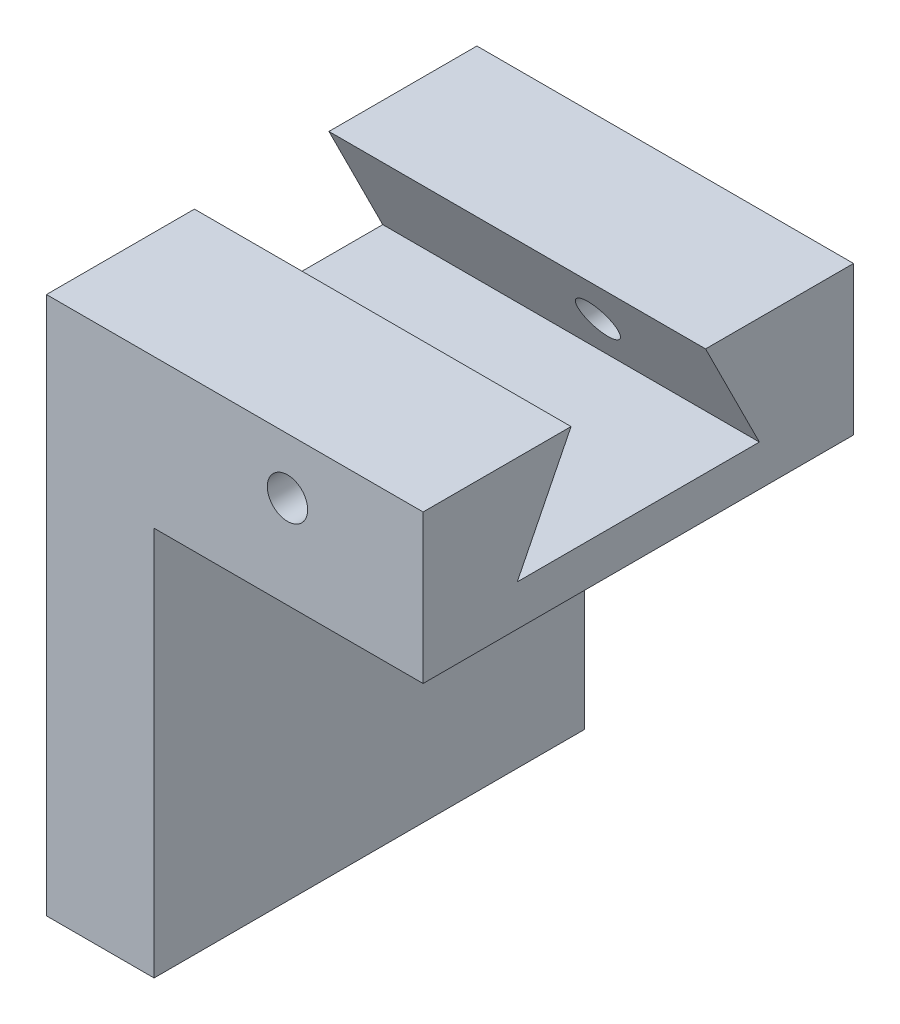
ISO-10303-21;
HEADER;
FILE_DESCRIPTION(('STEP AP214'),'2;1');
FILE_NAME('part.step','',(''),(''),'','','');
FILE_SCHEMA(('AUTOMOTIVE_DESIGN { 1 0 10303 214 1 1 1 1 }'));
ENDSEC;
DATA;
#1=APPLICATION_CONTEXT('core data for automotive mechanical design processes');
#2=APPLICATION_PROTOCOL_DEFINITION('international standard','automotive_design',2000,#1);
#3=PRODUCT_CONTEXT('',#1,'mechanical');
#4=PRODUCT('Part','Part','',(#3));
#5=PRODUCT_RELATED_PRODUCT_CATEGORY('part','',(#4));
#6=PRODUCT_DEFINITION_FORMATION('','',#4);
#7=PRODUCT_DEFINITION_CONTEXT('part definition',#1,'design');
#8=PRODUCT_DEFINITION('design','',#6,#7);
#9=PRODUCT_DEFINITION_SHAPE('','',#8);
#10=(LENGTH_UNIT() NAMED_UNIT(*) SI_UNIT(.MILLI.,.METRE.));
#11=(NAMED_UNIT(*) PLANE_ANGLE_UNIT() SI_UNIT($,.RADIAN.));
#12=(NAMED_UNIT(*) SI_UNIT($,.STERADIAN.) SOLID_ANGLE_UNIT());
#13=UNCERTAINTY_MEASURE_WITH_UNIT(LENGTH_MEASURE(1.E-05),#10,'distance_accuracy_value','');
#14=(GEOMETRIC_REPRESENTATION_CONTEXT(3) GLOBAL_UNCERTAINTY_ASSIGNED_CONTEXT((#13)) GLOBAL_UNIT_ASSIGNED_CONTEXT((#10,
#11,#12)) REPRESENTATION_CONTEXT('',''));
#15=CARTESIAN_POINT('',(0.,0.,0.));
#16=DIRECTION('',(0.,0.,1.));
#17=DIRECTION('',(1.,0.,0.));
#18=AXIS2_PLACEMENT_3D('',#15,#16,#17);
#19=CARTESIAN_POINT('',(-9.501,2.5,4.));
#20=DIRECTION('',(0.,-1.,0.));
#21=DIRECTION('',(0.,0.,-1.));
#22=AXIS2_PLACEMENT_3D('',#19,#20,#21);
#23=PLANE('',#22);
#24=DIRECTION('',(-1.,0.,0.));
#25=VECTOR('',#24,1.);
#26=CARTESIAN_POINT('',(-2.5,2.5,1.25));
#27=LINE('',#26,#25);
#28=CARTESIAN_POINT('',(-2.5,2.5,1.25));
#29=VERTEX_POINT('',#28);
#30=CARTESIAN_POINT('',(-9.5,2.5,1.25));
#31=VERTEX_POINT('',#30);
#32=EDGE_CURVE('E128',#29,#31,#27,.T.);
#33=ORIENTED_EDGE('',*,*,#32,.T.);
#34=DIRECTION('',(0.,0.,-1.));
#35=VECTOR('',#34,1.);
#36=CARTESIAN_POINT('',(-9.5,2.5,4.));
#37=LINE('',#36,#35);
#38=CARTESIAN_POINT('',(-9.5,2.5,4.));
#39=VERTEX_POINT('',#38);
#40=EDGE_CURVE('E159',#39,#31,#37,.T.);
#41=ORIENTED_EDGE('',*,*,#40,.F.);
#42=DIRECTION('',(1.,0.,0.));
#43=VECTOR('',#42,1.);
#44=CARTESIAN_POINT('',(-9.501,2.5,4.));
#45=LINE('',#44,#43);
#46=CARTESIAN_POINT('',(-2.5,2.5,4.));
#47=VERTEX_POINT('',#46);
#48=EDGE_CURVE('E157',#39,#47,#45,.T.);
#49=ORIENTED_EDGE('',*,*,#48,.T.);
#50=DIRECTION('',(0.,0.,1.));
#51=VECTOR('',#50,1.);
#52=CARTESIAN_POINT('',(-2.5,2.5,0.));
#53=LINE('',#52,#51);
#54=EDGE_CURVE('E77',#29,#47,#53,.T.);
#55=ORIENTED_EDGE('',*,*,#54,.F.);
#56=EDGE_LOOP('',(#33,#41,#49,#55));
#57=FACE_BOUND('',#56,.T.);
#58=ADVANCED_FACE('F36',(#57),#23,.F.);
#59=CARTESIAN_POINT('',(-7.5,-4.5,-4.001));
#60=DIRECTION('',(-1.,0.,0.));
#61=DIRECTION('',(0.,0.,1.));
#62=AXIS2_PLACEMENT_3D('',#59,#60,#61);
#63=PLANE('',#62);
#64=DIRECTION('',(0.,0.,-1.));
#65=VECTOR('',#64,1.);
#66=CARTESIAN_POINT('',(-7.5,-0.26095287369543,0.));
#67=LINE('',#66,#65);
#68=CARTESIAN_POINT('',(-7.5,-0.26095287369543,4.));
#69=VERTEX_POINT('',#68);
#70=CARTESIAN_POINT('',(-7.5,-0.26095287369543,-4.));
#71=VERTEX_POINT('',#70);
#72=EDGE_CURVE('E124',#69,#71,#67,.T.);
#73=ORIENTED_EDGE('',*,*,#72,.F.);
#74=DIRECTION('',(0.,-1.,0.));
#75=VECTOR('',#74,1.);
#76=CARTESIAN_POINT('',(-7.5,-4.5,4.));
#77=LINE('',#76,#75);
#78=CARTESIAN_POINT('',(-7.5,-7.50095287369543,4.));
#79=VERTEX_POINT('',#78);
#80=EDGE_CURVE('E140',#69,#79,#77,.T.);
#81=ORIENTED_EDGE('',*,*,#80,.T.);
#82=DIRECTION('',(0.,0.,-1.));
#83=VECTOR('',#82,1.);
#84=CARTESIAN_POINT('',(-7.5,-7.50095287369543,11.5111650228177));
#85=LINE('',#84,#83);
#86=CARTESIAN_POINT('',(-7.5,-7.50095287369543,-4.));
#87=VERTEX_POINT('',#86);
#88=EDGE_CURVE('E174',#79,#87,#85,.T.);
#89=ORIENTED_EDGE('',*,*,#88,.T.);
#90=DIRECTION('',(0.,1.,0.));
#91=VECTOR('',#90,1.);
#92=CARTESIAN_POINT('',(-7.5,-4.5,-4.));
#93=LINE('',#92,#91);
#94=EDGE_CURVE('E137',#87,#71,#93,.T.);
#95=ORIENTED_EDGE('',*,*,#94,.T.);
#96=EDGE_LOOP('',(#73,#81,#89,#95));
#97=FACE_BOUND('',#96,.T.);
#98=ADVANCED_FACE('F171',(#97),#63,.F.);
#99=CARTESIAN_POINT('',(-9.5,-4.5,4.));
#100=DIRECTION('',(-1.,0.,0.));
#101=DIRECTION('',(0.,0.,1.));
#102=AXIS2_PLACEMENT_3D('',#99,#100,#101);
#103=PLANE('',#102);
#104=DIRECTION('',(0.,-0.894427192382073,0.447213592735644));
#105=VECTOR('',#104,1.);
#106=CARTESIAN_POINT('',(-9.5,0.499999988410264,2.24999999806838));
#107=LINE('',#106,#105);
#108=CARTESIAN_POINT('',(-9.5,0.499999988410264,2.24999999806838));
#109=VERTEX_POINT('',#108);
#110=EDGE_CURVE('E188',#31,#109,#107,.T.);
#111=ORIENTED_EDGE('',*,*,#110,.T.);
#112=DIRECTION('',(0.,0.,-1.));
#113=VECTOR('',#112,1.);
#114=CARTESIAN_POINT('',(-9.5,0.499999988410264,-2.24999999806838));
#115=LINE('',#114,#113);
#116=CARTESIAN_POINT('',(-9.5,0.499999988410264,-2.24999999806838));
#117=VERTEX_POINT('',#116);
#118=EDGE_CURVE('E207',#109,#117,#115,.T.);
#119=ORIENTED_EDGE('',*,*,#118,.T.);
#120=DIRECTION('',(0.,0.894427192382073,0.447213592735644));
#121=VECTOR('',#120,1.);
#122=CARTESIAN_POINT('',(-9.5,2.5,-1.25));
#123=LINE('',#122,#121);
#124=CARTESIAN_POINT('',(-9.5,2.5,-1.25));
#125=VERTEX_POINT('',#124);
#126=EDGE_CURVE('E185',#117,#125,#123,.T.);
#127=ORIENTED_EDGE('',*,*,#126,.T.);
#128=CARTESIAN_POINT('',(-9.5,2.5,-4.));
#129=VERTEX_POINT('',#128);
#130=EDGE_CURVE('E99',#125,#129,#37,.T.);
#131=ORIENTED_EDGE('',*,*,#130,.T.);
#132=DIRECTION('',(0.,1.,0.));
#133=VECTOR('',#132,1.);
#134=CARTESIAN_POINT('',(-9.5,-4.5,-4.));
#135=LINE('',#134,#133);
#136=CARTESIAN_POINT('',(-9.5,-7.50095287369543,-4.));
#137=VERTEX_POINT('',#136);
#138=EDGE_CURVE('E46',#137,#129,#135,.T.);
#139=ORIENTED_EDGE('',*,*,#138,.F.);
#140=DIRECTION('',(0.,0.,-1.));
#141=VECTOR('',#140,1.);
#142=CARTESIAN_POINT('',(-9.5,-7.50095287369543,11.5111650228177));
#143=LINE('',#142,#141);
#144=CARTESIAN_POINT('',(-9.5,-7.50095287369543,4.));
#145=VERTEX_POINT('',#144);
#146=EDGE_CURVE('E181',#145,#137,#143,.T.);
#147=ORIENTED_EDGE('',*,*,#146,.F.);
#148=DIRECTION('',(0.,1.,0.));
#149=VECTOR('',#148,1.);
#150=CARTESIAN_POINT('',(-9.5,-4.5,4.));
#151=LINE('',#150,#149);
#152=EDGE_CURVE('E11',#145,#39,#151,.T.);
#153=ORIENTED_EDGE('',*,*,#152,.T.);
#154=ORIENTED_EDGE('',*,*,#40,.T.);
#155=EDGE_LOOP('',(#111,#119,#127,#131,#139,#147,#153,#154));
#156=FACE_BOUND('',#155,.T.);
#157=ADVANCED_FACE('F38',(#156),#103,.T.);
#158=CARTESIAN_POINT('',(0.,0.,4.));
#159=DIRECTION('',(0.,0.,1.));
#160=DIRECTION('',(1.,0.,0.));
#161=AXIS2_PLACEMENT_3D('',#158,#159,#160);
#162=PLANE('',#161);
#163=ORIENTED_EDGE('',*,*,#48,.F.);
#164=ORIENTED_EDGE('',*,*,#152,.F.);
#165=DIRECTION('',(-1.,0.,0.));
#166=VECTOR('',#165,1.);
#167=CARTESIAN_POINT('',(-7.5,-7.50095287369543,4.));
#168=LINE('',#167,#166);
#169=EDGE_CURVE('E184',#79,#145,#168,.T.);
#170=ORIENTED_EDGE('',*,*,#169,.F.);
#171=ORIENTED_EDGE('',*,*,#80,.F.);
#172=DIRECTION('',(-1.,0.,0.));
#173=VECTOR('',#172,1.);
#174=CARTESIAN_POINT('',(-2.5,-0.26095287369543,4.));
#175=LINE('',#174,#173);
#176=CARTESIAN_POINT('',(-2.5,-0.26095287369543,4.));
#177=VERTEX_POINT('',#176);
#178=EDGE_CURVE('E67',#177,#69,#175,.T.);
#179=ORIENTED_EDGE('',*,*,#178,.F.);
#180=DIRECTION('',(0.,-1.,0.));
#181=VECTOR('',#180,1.);
#182=CARTESIAN_POINT('',(-2.5,0.,4.));
#183=LINE('',#182,#181);
#184=EDGE_CURVE('E126',#47,#177,#183,.T.);
#185=ORIENTED_EDGE('',*,*,#184,.F.);
#186=EDGE_LOOP('',(#163,#164,#170,#171,#179,#185));
#187=FACE_BOUND('',#186,.T.);
#188=CARTESIAN_POINT('',(-5.01992730877987,1.46282170187639,4.));
#189=DIRECTION('',(0.,0.,1.));
#190=DIRECTION('',(1.,0.,0.));
#191=AXIS2_PLACEMENT_3D('',#188,#189,#190);
#192=CIRCLE('',#191,0.375);
#193=CARTESIAN_POINT('',(-4.64492730877987,1.46282170187639,4.));
#194=VERTEX_POINT('',#193);
#195=EDGE_CURVE('E195',#194,#194,#192,.F.);
#196=ORIENTED_EDGE('',*,*,#195,.T.);
#197=EDGE_LOOP('',(#196));
#198=FACE_BOUND('',#197,.T.);
#199=ADVANCED_FACE('F222',(#187,#198),#162,.T.);
#200=CARTESIAN_POINT('',(0.,0.,-4.));
#201=DIRECTION('',(0.,0.,1.));
#202=DIRECTION('',(1.,0.,0.));
#203=AXIS2_PLACEMENT_3D('',#200,#201,#202);
#204=PLANE('',#203);
#205=CARTESIAN_POINT('',(-5.01992730877987,1.46282170187639,-4.));
#206=DIRECTION('',(0.,0.,-1.));
#207=DIRECTION('',(-1.,0.,0.));
#208=AXIS2_PLACEMENT_3D('',#205,#206,#207);
#209=CIRCLE('',#208,0.375);
#210=CARTESIAN_POINT('',(-5.39492730877987,1.46282170187639,-4.));
#211=VERTEX_POINT('',#210);
#212=EDGE_CURVE('E180',#211,#211,#209,.T.);
#213=ORIENTED_EDGE('',*,*,#212,.F.);
#214=EDGE_LOOP('',(#213));
#215=FACE_BOUND('',#214,.T.);
#216=DIRECTION('',(-1.,0.,0.));
#217=VECTOR('',#216,1.);
#218=CARTESIAN_POINT('',(-2.5,-0.26095287369543,-4.));
#219=LINE('',#218,#217);
#220=CARTESIAN_POINT('',(-2.5,-0.26095287369543,-4.));
#221=VERTEX_POINT('',#220);
#222=EDGE_CURVE('E104',#221,#71,#219,.T.);
#223=ORIENTED_EDGE('',*,*,#222,.T.);
#224=ORIENTED_EDGE('',*,*,#94,.F.);
#225=DIRECTION('',(-1.,0.,0.));
#226=VECTOR('',#225,1.);
#227=CARTESIAN_POINT('',(-7.5,-7.50095287369543,-4.));
#228=LINE('',#227,#226);
#229=EDGE_CURVE('E151',#87,#137,#228,.T.);
#230=ORIENTED_EDGE('',*,*,#229,.T.);
#231=ORIENTED_EDGE('',*,*,#138,.T.);
#232=DIRECTION('',(1.,0.,0.));
#233=VECTOR('',#232,1.);
#234=CARTESIAN_POINT('',(-9.501,2.5,-4.));
#235=LINE('',#234,#233);
#236=CARTESIAN_POINT('',(-2.5,2.5,-4.));
#237=VERTEX_POINT('',#236);
#238=EDGE_CURVE('E127',#129,#237,#235,.T.);
#239=ORIENTED_EDGE('',*,*,#238,.T.);
#240=DIRECTION('',(0.,1.,0.));
#241=VECTOR('',#240,1.);
#242=CARTESIAN_POINT('',(-2.5,0.,-4.));
#243=LINE('',#242,#241);
#244=EDGE_CURVE('E113',#221,#237,#243,.T.);
#245=ORIENTED_EDGE('',*,*,#244,.F.);
#246=EDGE_LOOP('',(#223,#224,#230,#231,#239,#245));
#247=FACE_BOUND('',#246,.T.);
#248=ADVANCED_FACE('F147',(#215,#247),#204,.F.);
#249=CARTESIAN_POINT('',(-2.5,-0.26095287369543,0.));
#250=DIRECTION('',(0.,1.,0.));
#251=DIRECTION('',(0.,0.,1.));
#252=AXIS2_PLACEMENT_3D('',#249,#250,#251);
#253=PLANE('',#252);
#254=ORIENTED_EDGE('',*,*,#72,.T.);
#255=ORIENTED_EDGE('',*,*,#222,.F.);
#256=DIRECTION('',(0.,0.,-1.));
#257=VECTOR('',#256,1.);
#258=CARTESIAN_POINT('',(-2.5,-0.26095287369543,0.));
#259=LINE('',#258,#257);
#260=EDGE_CURVE('E164',#177,#221,#259,.T.);
#261=ORIENTED_EDGE('',*,*,#260,.F.);
#262=ORIENTED_EDGE('',*,*,#178,.T.);
#263=EDGE_LOOP('',(#254,#255,#261,#262));
#264=FACE_BOUND('',#263,.T.);
#265=ADVANCED_FACE('F167',(#264),#253,.F.);
#266=CARTESIAN_POINT('',(-2.5,0.99999999150086,-1.9999999984547));
#267=DIRECTION('',(0.,0.447213592735644,-0.894427192382073));
#268=DIRECTION('',(0.,0.894427192382073,0.447213592735644));
#269=AXIS2_PLACEMENT_3D('',#266,#267,#268);
#270=PLANE('',#269);
#271=CARTESIAN_POINT('',(-5.01992730877987,1.46282170187639,-1.76858914505493));
#272=DIRECTION('',(0.,0.447213592735644,-0.894427192382073));
#273=DIRECTION('',(0.,-0.894427192382073,-0.447213592735644));
#274=AXIS2_PLACEMENT_3D('',#271,#272,#273);
#275=ELLIPSE('',#274,0.419262745133325,0.375);
#276=CARTESIAN_POINT('',(-5.01992730877987,1.08782170187639,-1.95608914360621));
#277=VERTEX_POINT('',#276);
#278=EDGE_CURVE('E198',#277,#277,#275,.T.);
#279=ORIENTED_EDGE('',*,*,#278,.T.);
#280=EDGE_LOOP('',(#279));
#281=FACE_BOUND('',#280,.T.);
#282=DIRECTION('',(-1.,0.,0.));
#283=VECTOR('',#282,1.);
#284=CARTESIAN_POINT('',(-2.5,2.5,-1.25));
#285=LINE('',#284,#283);
#286=CARTESIAN_POINT('',(-2.5,2.5,-1.25));
#287=VERTEX_POINT('',#286);
#288=EDGE_CURVE('E91',#287,#125,#285,.T.);
#289=ORIENTED_EDGE('',*,*,#288,.T.);
#290=ORIENTED_EDGE('',*,*,#126,.F.);
#291=DIRECTION('',(-1.,0.,0.));
#292=VECTOR('',#291,1.);
#293=CARTESIAN_POINT('',(-2.5,0.499999988410264,-2.24999999806838));
#294=LINE('',#293,#292);
#295=CARTESIAN_POINT('',(-2.5,0.499999988410264,-2.24999999806838));
#296=VERTEX_POINT('',#295);
#297=EDGE_CURVE('E105',#296,#117,#294,.T.);
#298=ORIENTED_EDGE('',*,*,#297,.F.);
#299=DIRECTION('',(0.,-0.894427192382073,-0.447213592735644));
#300=VECTOR('',#299,1.);
#301=CARTESIAN_POINT('',(-2.5,0.99999999150086,-1.9999999984547));
#302=LINE('',#301,#300);
#303=EDGE_CURVE('E110',#287,#296,#302,.T.);
#304=ORIENTED_EDGE('',*,*,#303,.F.);
#305=EDGE_LOOP('',(#289,#290,#298,#304));
#306=FACE_BOUND('',#305,.T.);
#307=ADVANCED_FACE('F115',(#281,#306),#270,.F.);
#308=CARTESIAN_POINT('',(-2.5,0.499999988410264,0.));
#309=DIRECTION('',(0.,-1.,0.));
#310=DIRECTION('',(0.,0.,-1.));
#311=AXIS2_PLACEMENT_3D('',#308,#309,#310);
#312=PLANE('',#311);
#313=ORIENTED_EDGE('',*,*,#297,.T.);
#314=ORIENTED_EDGE('',*,*,#118,.F.);
#315=DIRECTION('',(-1.,0.,0.));
#316=VECTOR('',#315,1.);
#317=CARTESIAN_POINT('',(-2.5,0.499999988410264,2.24999999806838));
#318=LINE('',#317,#316);
#319=CARTESIAN_POINT('',(-2.5,0.499999988410264,2.24999999806838));
#320=VERTEX_POINT('',#319);
#321=EDGE_CURVE('E130',#320,#109,#318,.T.);
#322=ORIENTED_EDGE('',*,*,#321,.F.);
#323=DIRECTION('',(0.,0.,1.));
#324=VECTOR('',#323,1.);
#325=CARTESIAN_POINT('',(-2.5,0.499999988410264,0.));
#326=LINE('',#325,#324);
#327=EDGE_CURVE('E55',#296,#320,#326,.T.);
#328=ORIENTED_EDGE('',*,*,#327,.F.);
#329=EDGE_LOOP('',(#313,#314,#322,#328));
#330=FACE_BOUND('',#329,.T.);
#331=ADVANCED_FACE('F252',(#330),#312,.F.);
#332=CARTESIAN_POINT('',(-2.5,0.999999991500858,1.9999999984547));
#333=DIRECTION('',(0.,-0.447213592735644,-0.894427192382073));
#334=DIRECTION('',(0.,0.894427192382073,-0.447213592735644));
#335=AXIS2_PLACEMENT_3D('',#332,#333,#334);
#336=PLANE('',#335);
#337=CARTESIAN_POINT('',(-5.01992730877987,1.46282170187639,1.76858914505493));
#338=DIRECTION('',(0.,-0.447213592735644,-0.894427192382073));
#339=DIRECTION('',(0.,0.894427192382073,-0.447213592735644));
#340=AXIS2_PLACEMENT_3D('',#337,#338,#339);
#341=ELLIPSE('',#340,0.419262745133325,0.375);
#342=CARTESIAN_POINT('',(-5.01992730877987,1.83782170187639,1.58108914650365));
#343=VERTEX_POINT('',#342);
#344=EDGE_CURVE('E40',#343,#343,#341,.T.);
#345=ORIENTED_EDGE('',*,*,#344,.F.);
#346=EDGE_LOOP('',(#345));
#347=FACE_BOUND('',#346,.T.);
#348=ORIENTED_EDGE('',*,*,#321,.T.);
#349=ORIENTED_EDGE('',*,*,#110,.F.);
#350=ORIENTED_EDGE('',*,*,#32,.F.);
#351=DIRECTION('',(0.,-0.894427192382073,0.447213592735644));
#352=VECTOR('',#351,1.);
#353=CARTESIAN_POINT('',(-2.5,0.999999991500858,1.9999999984547));
#354=LINE('',#353,#352);
#355=EDGE_CURVE('E118',#29,#320,#354,.T.);
#356=ORIENTED_EDGE('',*,*,#355,.T.);
#357=EDGE_LOOP('',(#348,#349,#350,#356));
#358=FACE_BOUND('',#357,.T.);
#359=ADVANCED_FACE('F249',(#347,#358),#336,.T.);
#360=CARTESIAN_POINT('',(-2.5,0.,0.));
#361=DIRECTION('',(1.,0.,0.));
#362=DIRECTION('',(0.,0.,-1.));
#363=AXIS2_PLACEMENT_3D('',#360,#361,#362);
#364=PLANE('',#363);
#365=ORIENTED_EDGE('',*,*,#184,.T.);
#366=ORIENTED_EDGE('',*,*,#260,.T.);
#367=ORIENTED_EDGE('',*,*,#244,.T.);
#368=EDGE_CURVE('E95',#237,#287,#53,.T.);
#369=ORIENTED_EDGE('',*,*,#368,.T.);
#370=ORIENTED_EDGE('',*,*,#303,.T.);
#371=ORIENTED_EDGE('',*,*,#327,.T.);
#372=ORIENTED_EDGE('',*,*,#355,.F.);
#373=ORIENTED_EDGE('',*,*,#54,.T.);
#374=EDGE_LOOP('',(#365,#366,#367,#369,#370,#371,#372,#373));
#375=FACE_BOUND('',#374,.T.);
#376=ADVANCED_FACE('F109',(#375),#364,.T.);
#377=ORIENTED_EDGE('',*,*,#130,.F.);
#378=ORIENTED_EDGE('',*,*,#288,.F.);
#379=ORIENTED_EDGE('',*,*,#368,.F.);
#380=ORIENTED_EDGE('',*,*,#238,.F.);
#381=EDGE_LOOP('',(#377,#378,#379,#380));
#382=FACE_BOUND('',#381,.T.);
#383=ADVANCED_FACE('F93',(#382),#23,.F.);
#384=CARTESIAN_POINT('',(-5.01992730877987,1.46282170187639,5.06066017177982));
#385=DIRECTION('',(0.,0.,-1.));
#386=DIRECTION('',(-1.,0.,0.));
#387=AXIS2_PLACEMENT_3D('',#384,#385,#386);
#388=CYLINDRICAL_SURFACE('',#387,0.375);
#389=ORIENTED_EDGE('',*,*,#344,.T.);
#390=EDGE_LOOP('',(#389));
#391=FACE_BOUND('',#390,.T.);
#392=ORIENTED_EDGE('',*,*,#195,.F.);
#393=EDGE_LOOP('',(#392));
#394=FACE_BOUND('',#393,.T.);
#395=ADVANCED_FACE('F228',(#391,#394),#388,.F.);
#396=ORIENTED_EDGE('',*,*,#212,.T.);
#397=EDGE_LOOP('',(#396));
#398=FACE_BOUND('',#397,.T.);
#399=ORIENTED_EDGE('',*,*,#278,.F.);
#400=EDGE_LOOP('',(#399));
#401=FACE_BOUND('',#400,.T.);
#402=ADVANCED_FACE('F230',(#398,#401),#388,.F.);
#403=CARTESIAN_POINT('',(-7.5,-7.50095287369543,11.5111650228177));
#404=DIRECTION('',(0.,-1.,0.));
#405=DIRECTION('',(0.,0.,-1.));
#406=AXIS2_PLACEMENT_3D('',#403,#404,#405);
#407=PLANE('',#406);
#408=ORIENTED_EDGE('',*,*,#88,.F.);
#409=ORIENTED_EDGE('',*,*,#169,.T.);
#410=ORIENTED_EDGE('',*,*,#146,.T.);
#411=ORIENTED_EDGE('',*,*,#229,.F.);
#412=EDGE_LOOP('',(#408,#409,#410,#411));
#413=FACE_BOUND('',#412,.T.);
#414=ADVANCED_FACE('F183',(#413),#407,.T.);
#415=CLOSED_SHELL('',(#58,#98,#157,#199,#248,#265,#307,#331,#359,#376,#383,#395,#402,#414));
#416=MANIFOLD_SOLID_BREP('B2',#415);
#417=ADVANCED_BREP_SHAPE_REPRESENTATION('',(#18,#416),#14);
#418=SHAPE_DEFINITION_REPRESENTATION(#9,#417);
ENDSEC;
END-ISO-10303-21;
